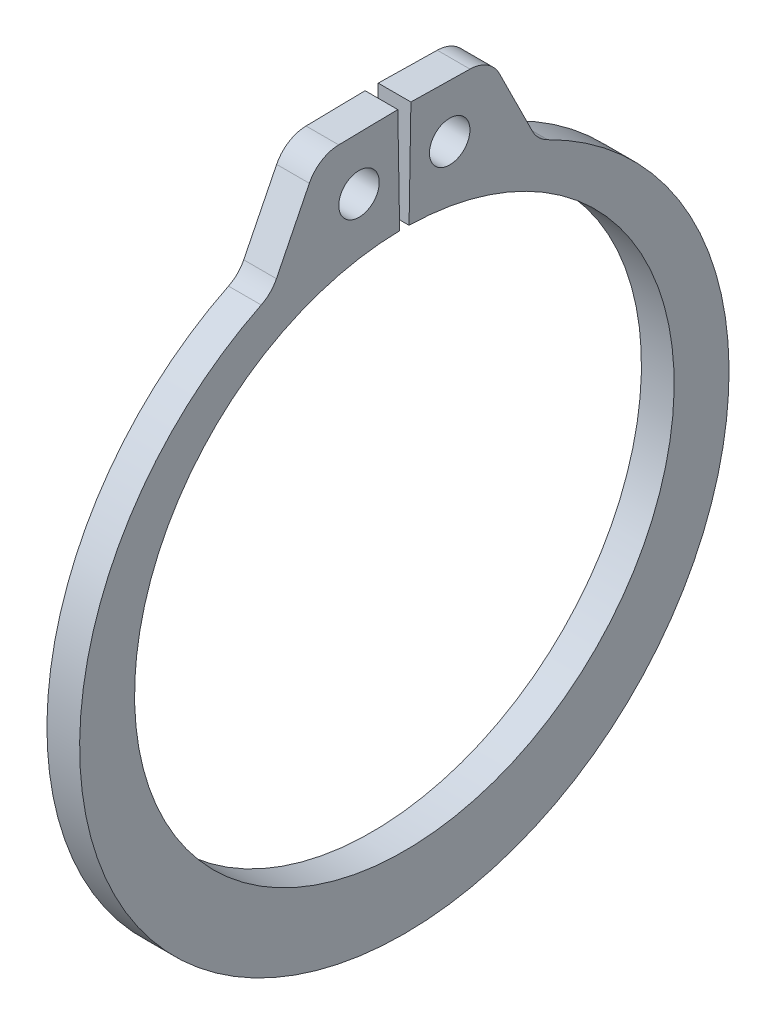
ISO-10303-21;
HEADER;
FILE_DESCRIPTION(('STEP AP214'),'2;1');
FILE_NAME('part.step','',(''),(''),'','','');
FILE_SCHEMA(('AUTOMOTIVE_DESIGN { 1 0 10303 214 1 1 1 1 }'));
ENDSEC;
DATA;
#1=APPLICATION_CONTEXT('core data for automotive mechanical design processes');
#2=APPLICATION_PROTOCOL_DEFINITION('international standard','automotive_design',2000,#1);
#3=PRODUCT_CONTEXT('',#1,'mechanical');
#4=PRODUCT('Part','Part','',(#3));
#5=PRODUCT_RELATED_PRODUCT_CATEGORY('part','',(#4));
#6=PRODUCT_DEFINITION_FORMATION('','',#4);
#7=PRODUCT_DEFINITION_CONTEXT('part definition',#1,'design');
#8=PRODUCT_DEFINITION('design','',#6,#7);
#9=PRODUCT_DEFINITION_SHAPE('','',#8);
#10=(LENGTH_UNIT() NAMED_UNIT(*) SI_UNIT(.MILLI.,.METRE.));
#11=(NAMED_UNIT(*) PLANE_ANGLE_UNIT() SI_UNIT($,.RADIAN.));
#12=(NAMED_UNIT(*) SI_UNIT($,.STERADIAN.) SOLID_ANGLE_UNIT());
#13=UNCERTAINTY_MEASURE_WITH_UNIT(LENGTH_MEASURE(1.E-05),#10,'distance_accuracy_value','');
#14=(GEOMETRIC_REPRESENTATION_CONTEXT(3) GLOBAL_UNCERTAINTY_ASSIGNED_CONTEXT((#13)) GLOBAL_UNIT_ASSIGNED_CONTEXT((#10,
#11,#12)) REPRESENTATION_CONTEXT('',''));
#15=CARTESIAN_POINT('',(0.,0.,0.));
#16=DIRECTION('',(0.,0.,1.));
#17=DIRECTION('',(1.,0.,0.));
#18=AXIS2_PLACEMENT_3D('',#15,#16,#17);
#19=CARTESIAN_POINT('',(0.5334,0.,0.));
#20=DIRECTION('',(1.,0.,0.));
#21=DIRECTION('',(0.,0.,-1.));
#22=AXIS2_PLACEMENT_3D('',#19,#20,#21);
#23=PLANE('',#22);
#24=CARTESIAN_POINT('',(0.5334,10.5040886416162,-1.47894687499924));
#25=DIRECTION('',(-1.,0.,0.));
#26=DIRECTION('',(0.,0.,1.));
#27=AXIS2_PLACEMENT_3D('',#24,#25,#26);
#28=CIRCLE('',#27,0.6604);
#29=CARTESIAN_POINT('',(0.5334,10.5040886416162,-0.818546874999241));
#30=VERTEX_POINT('',#29);
#31=EDGE_CURVE('E107',#30,#30,#28,.T.);
#32=ORIENTED_EDGE('',*,*,#31,.T.);
#33=EDGE_LOOP('',(#32));
#34=FACE_BOUND('',#33,.T.);
#35=CARTESIAN_POINT('',(0.5334,0.,0.));
#36=DIRECTION('',(-1.,0.,0.));
#37=DIRECTION('',(0.,0.,1.));
#38=AXIS2_PLACEMENT_3D('',#35,#36,#37);
#39=CIRCLE('',#38,8.8011);
#40=CARTESIAN_POINT('',(0.5334,8.79975954984091,-0.153600374295176));
#41=VERTEX_POINT('',#40);
#42=CARTESIAN_POINT('',(0.5334,8.79975954984091,0.153600374295176));
#43=VERTEX_POINT('',#42);
#44=EDGE_CURVE('E173',#41,#43,#39,.T.);
#45=ORIENTED_EDGE('',*,*,#44,.T.);
#46=DIRECTION('',(0.,-0.999847695156391,-0.0174524064372835));
#47=VECTOR('',#46,1.);
#48=CARTESIAN_POINT('',(0.5334,8.79975954984091,0.153600374295176));
#49=LINE('',#48,#47);
#50=CARTESIAN_POINT('',(0.5334,12.2536334279892,0.213887967092128));
#51=VERTEX_POINT('',#50);
#52=EDGE_CURVE('E123',#43,#51,#49,.F.);
#53=ORIENTED_EDGE('',*,*,#52,.T.);
#54=DIRECTION('',(0.,0.0174524064372834,-0.999847695156391));
#55=VECTOR('',#54,1.);
#56=CARTESIAN_POINT('',(0.5334,12.2536334279892,0.213887967092128));
#57=LINE('',#56,#55);
#58=CARTESIAN_POINT('',(0.5334,12.21999978275,2.14075821234738));
#59=VERTEX_POINT('',#58);
#60=EDGE_CURVE('E118',#51,#59,#57,.F.);
#61=ORIENTED_EDGE('',*,*,#60,.T.);
#62=CARTESIAN_POINT('',(0.5334,11.1279661301002,2.12169669403658));
#63=DIRECTION('',(-1.,0.,0.));
#64=DIRECTION('',(0.,0.,1.));
#65=AXIS2_PLACEMENT_3D('',#62,#63,#64);
#66=CIRCLE('',#65,1.0922);
#67=CARTESIAN_POINT('',(0.5334,11.6141614114107,3.09971253666458));
#68=VERTEX_POINT('',#67);
#69=EDGE_CURVE('E111',#68,#59,#66,.T.);
#70=ORIENTED_EDGE('',*,*,#69,.F.);
#71=DIRECTION('',(0.,0.895454900776411,-0.445152244378829));
#72=VECTOR('',#71,1.);
#73=CARTESIAN_POINT('',(0.5334,12.2084177333914,2.80429337570331));
#74=LINE('',#73,#72);
#75=CARTESIAN_POINT('',(0.5334,9.45539137797145,4.17288922557434));
#76=VERTEX_POINT('',#75);
#77=EDGE_CURVE('E106',#68,#76,#74,.F.);
#78=ORIENTED_EDGE('',*,*,#77,.T.);
#79=CARTESIAN_POINT('',(0.5334,9.941586659282,5.15090506820234));
#80=DIRECTION('',(-1.,0.,0.));
#81=DIRECTION('',(0.,0.,1.));
#82=AXIS2_PLACEMENT_3D('',#79,#80,#81);
#83=CIRCLE('',#82,1.0922);
#84=CARTESIAN_POINT('',(0.5334,8.96124610534802,4.66941442622431));
#85=VERTEX_POINT('',#84);
#86=EDGE_CURVE('E97',#76,#85,#83,.T.);
#87=ORIENTED_EDGE('',*,*,#86,.T.);
#88=CARTESIAN_POINT('',(0.5334,-0.545929997486656,0.));
#89=DIRECTION('',(-1.,0.,0.));
#90=DIRECTION('',(0.,0.,1.));
#91=AXIS2_PLACEMENT_3D('',#88,#89,#90);
#92=CIRCLE('',#91,10.5919700025133);
#93=CARTESIAN_POINT('',(0.5334,8.96124610534802,-4.66941442622431));
#94=VERTEX_POINT('',#93);
#95=EDGE_CURVE('E180',#94,#85,#92,.T.);
#96=ORIENTED_EDGE('',*,*,#95,.F.);
#97=CARTESIAN_POINT('',(0.5334,9.941586659282,-5.15090506820234));
#98=DIRECTION('',(-1.,0.,0.));
#99=DIRECTION('',(0.,0.,1.));
#100=AXIS2_PLACEMENT_3D('',#97,#98,#99);
#101=CIRCLE('',#100,1.0922);
#102=CARTESIAN_POINT('',(0.5334,9.45539137797145,-4.17288922557434));
#103=VERTEX_POINT('',#102);
#104=EDGE_CURVE('E177',#94,#103,#101,.T.);
#105=ORIENTED_EDGE('',*,*,#104,.T.);
#106=DIRECTION('',(0.,-0.895454900776411,-0.445152244378829));
#107=VECTOR('',#106,1.);
#108=CARTESIAN_POINT('',(0.5334,12.2084177333914,-2.80429337570331));
#109=LINE('',#108,#107);
#110=CARTESIAN_POINT('',(0.5334,11.6141614114107,-3.09971253666458));
#111=VERTEX_POINT('',#110);
#112=EDGE_CURVE('E142',#103,#111,#109,.F.);
#113=ORIENTED_EDGE('',*,*,#112,.T.);
#114=CARTESIAN_POINT('',(0.5334,11.1279661301002,-2.12169669403658));
#115=DIRECTION('',(-1.,0.,0.));
#116=DIRECTION('',(0.,0.,1.));
#117=AXIS2_PLACEMENT_3D('',#114,#115,#116);
#118=CIRCLE('',#117,1.0922);
#119=CARTESIAN_POINT('',(0.5334,12.21999978275,-2.14075821234738));
#120=VERTEX_POINT('',#119);
#121=EDGE_CURVE('E144',#120,#111,#118,.T.);
#122=ORIENTED_EDGE('',*,*,#121,.F.);
#123=DIRECTION('',(0.,-0.0174524064372834,-0.999847695156391));
#124=VECTOR('',#123,1.);
#125=CARTESIAN_POINT('',(0.5334,12.2536334279892,-0.213887967092128));
#126=LINE('',#125,#124);
#127=CARTESIAN_POINT('',(0.5334,12.2536334279892,-0.213887967092128));
#128=VERTEX_POINT('',#127);
#129=EDGE_CURVE('E136',#120,#128,#126,.F.);
#130=ORIENTED_EDGE('',*,*,#129,.T.);
#131=DIRECTION('',(0.,0.999847695156391,-0.0174524064372835));
#132=VECTOR('',#131,1.);
#133=CARTESIAN_POINT('',(0.5334,8.79975954984091,-0.153600374295176));
#134=LINE('',#133,#132);
#135=EDGE_CURVE('E129',#128,#41,#134,.F.);
#136=ORIENTED_EDGE('',*,*,#135,.T.);
#137=EDGE_LOOP('',(#45,#53,#61,#70,#78,#87,#96,#105,#113,#122,#130,#136));
#138=FACE_BOUND('',#137,.T.);
#139=CARTESIAN_POINT('',(0.5334,10.5040886416162,1.47894687499924));
#140=DIRECTION('',(-1.,0.,0.));
#141=DIRECTION('',(0.,0.,1.));
#142=AXIS2_PLACEMENT_3D('',#139,#140,#141);
#143=CIRCLE('',#142,0.6604);
#144=CARTESIAN_POINT('',(0.5334,10.5040886416162,2.13934687499924));
#145=VERTEX_POINT('',#144);
#146=EDGE_CURVE('E19',#145,#145,#143,.T.);
#147=ORIENTED_EDGE('',*,*,#146,.T.);
#148=EDGE_LOOP('',(#147));
#149=FACE_BOUND('',#148,.T.);
#150=ADVANCED_FACE('F16',(#34,#138,#149),#23,.T.);
#151=CARTESIAN_POINT('',(0.5334,10.5040886416162,1.47894687499924));
#152=DIRECTION('',(-1.,0.,0.));
#153=DIRECTION('',(0.,0.,1.));
#154=AXIS2_PLACEMENT_3D('',#151,#152,#153);
#155=CYLINDRICAL_SURFACE('',#154,0.6604);
#156=CARTESIAN_POINT('',(-0.5334,10.5040886416162,1.47894687499924));
#157=DIRECTION('',(-1.,0.,0.));
#158=DIRECTION('',(0.,0.,1.));
#159=AXIS2_PLACEMENT_3D('',#156,#157,#158);
#160=CIRCLE('',#159,0.6604);
#161=CARTESIAN_POINT('',(-0.5334,10.5040886416162,2.13934687499924));
#162=VERTEX_POINT('',#161);
#163=EDGE_CURVE('E167',#162,#162,#160,.T.);
#164=ORIENTED_EDGE('',*,*,#163,.T.);
#165=EDGE_LOOP('',(#164));
#166=FACE_BOUND('',#165,.T.);
#167=ORIENTED_EDGE('',*,*,#146,.F.);
#168=EDGE_LOOP('',(#167));
#169=FACE_BOUND('',#168,.T.);
#170=ADVANCED_FACE('F387',(#166,#169),#155,.F.);
#171=CARTESIAN_POINT('',(0.5334,9.941586659282,5.15090506820234));
#172=DIRECTION('',(-1.,0.,0.));
#173=DIRECTION('',(0.,0.,1.));
#174=AXIS2_PLACEMENT_3D('',#171,#172,#173);
#175=CYLINDRICAL_SURFACE('',#174,1.0922);
#176=DIRECTION('',(1.,0.,0.));
#177=VECTOR('',#176,1.);
#178=CARTESIAN_POINT('',(0.5334,9.45539137797145,4.17288922557434));
#179=LINE('',#178,#177);
#180=CARTESIAN_POINT('',(-0.5334,9.45539137797145,4.17288922557434));
#181=VERTEX_POINT('',#180);
#182=EDGE_CURVE('E101',#76,#181,#179,.F.);
#183=ORIENTED_EDGE('',*,*,#182,.T.);
#184=CARTESIAN_POINT('',(-0.5334,9.941586659282,5.15090506820234));
#185=DIRECTION('',(-1.,0.,0.));
#186=DIRECTION('',(0.,0.,1.));
#187=AXIS2_PLACEMENT_3D('',#184,#185,#186);
#188=CIRCLE('',#187,1.0922);
#189=CARTESIAN_POINT('',(-0.5334,8.96124610534802,4.66941442622431));
#190=VERTEX_POINT('',#189);
#191=EDGE_CURVE('E165',#181,#190,#188,.T.);
#192=ORIENTED_EDGE('',*,*,#191,.T.);
#193=DIRECTION('',(-1.,0.,0.));
#194=VECTOR('',#193,1.);
#195=CARTESIAN_POINT('',(0.5334,8.96124610534802,4.66941442622431));
#196=LINE('',#195,#194);
#197=EDGE_CURVE('E102',#85,#190,#196,.T.);
#198=ORIENTED_EDGE('',*,*,#197,.F.);
#199=ORIENTED_EDGE('',*,*,#86,.F.);
#200=EDGE_LOOP('',(#183,#192,#198,#199));
#201=FACE_BOUND('',#200,.T.);
#202=ADVANCED_FACE('F99',(#201),#175,.F.);
#203=CARTESIAN_POINT('',(0.5334,-0.545929997486656,0.));
#204=DIRECTION('',(-1.,0.,0.));
#205=DIRECTION('',(0.,0.,1.));
#206=AXIS2_PLACEMENT_3D('',#203,#204,#205);
#207=CYLINDRICAL_SURFACE('',#206,10.5919700025133);
#208=CARTESIAN_POINT('',(-0.5334,-0.545929997486656,0.));
#209=DIRECTION('',(-1.,0.,0.));
#210=DIRECTION('',(0.,0.,1.));
#211=AXIS2_PLACEMENT_3D('',#208,#209,#210);
#212=CIRCLE('',#211,10.5919700025133);
#213=CARTESIAN_POINT('',(-0.5334,8.96124610534802,-4.66941442622431));
#214=VERTEX_POINT('',#213);
#215=EDGE_CURVE('E163',#190,#214,#212,.F.);
#216=ORIENTED_EDGE('',*,*,#215,.T.);
#217=DIRECTION('',(-1.,0.,0.));
#218=VECTOR('',#217,1.);
#219=CARTESIAN_POINT('',(0.5334,8.96124610534802,-4.66941442622431));
#220=LINE('',#219,#218);
#221=EDGE_CURVE('E179',#214,#94,#220,.F.);
#222=ORIENTED_EDGE('',*,*,#221,.T.);
#223=ORIENTED_EDGE('',*,*,#95,.T.);
#224=ORIENTED_EDGE('',*,*,#197,.T.);
#225=EDGE_LOOP('',(#216,#222,#223,#224));
#226=FACE_BOUND('',#225,.T.);
#227=ADVANCED_FACE('F185',(#226),#207,.T.);
#228=CARTESIAN_POINT('',(0.5334,9.941586659282,-5.15090506820234));
#229=DIRECTION('',(-1.,0.,0.));
#230=DIRECTION('',(0.,0.,1.));
#231=AXIS2_PLACEMENT_3D('',#228,#229,#230);
#232=CYLINDRICAL_SURFACE('',#231,1.0922);
#233=ORIENTED_EDGE('',*,*,#221,.F.);
#234=CARTESIAN_POINT('',(-0.5334,9.941586659282,-5.15090506820234));
#235=DIRECTION('',(-1.,0.,0.));
#236=DIRECTION('',(0.,0.,1.));
#237=AXIS2_PLACEMENT_3D('',#234,#235,#236);
#238=CIRCLE('',#237,1.0922);
#239=CARTESIAN_POINT('',(-0.5334,9.45539137797145,-4.17288922557434));
#240=VERTEX_POINT('',#239);
#241=EDGE_CURVE('E160',#214,#240,#238,.T.);
#242=ORIENTED_EDGE('',*,*,#241,.T.);
#243=DIRECTION('',(1.,0.,0.));
#244=VECTOR('',#243,1.);
#245=CARTESIAN_POINT('',(0.5334,9.45539137797145,-4.17288922557434));
#246=LINE('',#245,#244);
#247=EDGE_CURVE('E145',#240,#103,#246,.T.);
#248=ORIENTED_EDGE('',*,*,#247,.T.);
#249=ORIENTED_EDGE('',*,*,#104,.F.);
#250=EDGE_LOOP('',(#233,#242,#248,#249));
#251=FACE_BOUND('',#250,.T.);
#252=ADVANCED_FACE('F197',(#251),#232,.F.);
#253=CARTESIAN_POINT('',(0.5334,12.2084177333914,-2.80429337570331));
#254=DIRECTION('',(0.,-0.445152244378829,0.895454900776411));
#255=DIRECTION('',(0.,-0.895454900776411,-0.445152244378829));
#256=AXIS2_PLACEMENT_3D('',#253,#254,#255);
#257=PLANE('',#256);
#258=ORIENTED_EDGE('',*,*,#247,.F.);
#259=DIRECTION('',(0.,0.895454900776411,0.445152244378828));
#260=VECTOR('',#259,1.);
#261=CARTESIAN_POINT('',(-0.5334,9.45539137797145,-4.17288922557434));
#262=LINE('',#261,#260);
#263=CARTESIAN_POINT('',(-0.5334,11.6141614114107,-3.09971253666458));
#264=VERTEX_POINT('',#263);
#265=EDGE_CURVE('E159',#240,#264,#262,.T.);
#266=ORIENTED_EDGE('',*,*,#265,.T.);
#267=DIRECTION('',(-1.,0.,0.));
#268=VECTOR('',#267,1.);
#269=CARTESIAN_POINT('',(0.5334,11.6141614114107,-3.09971253666458));
#270=LINE('',#269,#268);
#271=EDGE_CURVE('E176',#111,#264,#270,.T.);
#272=ORIENTED_EDGE('',*,*,#271,.F.);
#273=ORIENTED_EDGE('',*,*,#112,.F.);
#274=EDGE_LOOP('',(#258,#266,#272,#273));
#275=FACE_BOUND('',#274,.T.);
#276=ADVANCED_FACE('F202',(#275),#257,.F.);
#277=CARTESIAN_POINT('',(0.5334,11.1279661301002,-2.12169669403658));
#278=DIRECTION('',(-1.,0.,0.));
#279=DIRECTION('',(0.,0.,1.));
#280=AXIS2_PLACEMENT_3D('',#277,#278,#279);
#281=CYLINDRICAL_SURFACE('',#280,1.0922);
#282=CARTESIAN_POINT('',(-0.5334,11.1279661301002,-2.12169669403658));
#283=DIRECTION('',(-1.,0.,0.));
#284=DIRECTION('',(0.,0.,1.));
#285=AXIS2_PLACEMENT_3D('',#282,#283,#284);
#286=CIRCLE('',#285,1.0922);
#287=CARTESIAN_POINT('',(-0.5334,12.21999978275,-2.14075821234738));
#288=VERTEX_POINT('',#287);
#289=EDGE_CURVE('E155',#264,#288,#286,.F.);
#290=ORIENTED_EDGE('',*,*,#289,.T.);
#291=DIRECTION('',(1.,0.,0.));
#292=VECTOR('',#291,1.);
#293=CARTESIAN_POINT('',(0.5334,12.21999978275,-2.14075821234738));
#294=LINE('',#293,#292);
#295=EDGE_CURVE('E139',#288,#120,#294,.T.);
#296=ORIENTED_EDGE('',*,*,#295,.T.);
#297=ORIENTED_EDGE('',*,*,#121,.T.);
#298=ORIENTED_EDGE('',*,*,#271,.T.);
#299=EDGE_LOOP('',(#290,#296,#297,#298));
#300=FACE_BOUND('',#299,.T.);
#301=ADVANCED_FACE('F265',(#300),#281,.T.);
#302=CARTESIAN_POINT('',(0.5334,12.2536334279892,-0.213887967092128));
#303=DIRECTION('',(0.,-0.999847695156391,0.0174524064372834));
#304=DIRECTION('',(0.,-0.0174524064372834,-0.999847695156391));
#305=AXIS2_PLACEMENT_3D('',#302,#303,#304);
#306=PLANE('',#305);
#307=ORIENTED_EDGE('',*,*,#295,.F.);
#308=DIRECTION('',(0.,0.0174524064372837,0.999847695156391));
#309=VECTOR('',#308,1.);
#310=CARTESIAN_POINT('',(-0.5334,12.21999978275,-2.14075821234738));
#311=LINE('',#310,#309);
#312=CARTESIAN_POINT('',(-0.5334,12.2536334279892,-0.213887967092128));
#313=VERTEX_POINT('',#312);
#314=EDGE_CURVE('E158',#288,#313,#311,.T.);
#315=ORIENTED_EDGE('',*,*,#314,.T.);
#316=DIRECTION('',(1.,0.,0.));
#317=VECTOR('',#316,1.);
#318=CARTESIAN_POINT('',(0.5334,12.2536334279892,-0.213887967092128));
#319=LINE('',#318,#317);
#320=EDGE_CURVE('E133',#313,#128,#319,.T.);
#321=ORIENTED_EDGE('',*,*,#320,.T.);
#322=ORIENTED_EDGE('',*,*,#129,.F.);
#323=EDGE_LOOP('',(#307,#315,#321,#322));
#324=FACE_BOUND('',#323,.T.);
#325=ADVANCED_FACE('F263',(#324),#306,.F.);
#326=CARTESIAN_POINT('',(0.5334,8.79975954984091,-0.153600374295176));
#327=DIRECTION('',(0.,-0.0174524064372835,-0.999847695156391));
#328=DIRECTION('',(0.,0.999847695156391,-0.0174524064372835));
#329=AXIS2_PLACEMENT_3D('',#326,#327,#328);
#330=PLANE('',#329);
#331=DIRECTION('',(-1.,0.,0.));
#332=VECTOR('',#331,1.);
#333=CARTESIAN_POINT('',(0.5334,8.79975954984091,-0.153600374295176));
#334=LINE('',#333,#332);
#335=CARTESIAN_POINT('',(-0.5334,8.79975954984091,-0.153600374295176));
#336=VERTEX_POINT('',#335);
#337=EDGE_CURVE('E132',#336,#41,#334,.F.);
#338=ORIENTED_EDGE('',*,*,#337,.T.);
#339=ORIENTED_EDGE('',*,*,#135,.F.);
#340=ORIENTED_EDGE('',*,*,#320,.F.);
#341=DIRECTION('',(0.,-0.999847695156391,0.0174524064372835));
#342=VECTOR('',#341,1.);
#343=CARTESIAN_POINT('',(-0.5334,12.2536334279892,-0.213887967092128));
#344=LINE('',#343,#342);
#345=EDGE_CURVE('E154',#313,#336,#344,.T.);
#346=ORIENTED_EDGE('',*,*,#345,.T.);
#347=EDGE_LOOP('',(#338,#339,#340,#346));
#348=FACE_BOUND('',#347,.T.);
#349=ADVANCED_FACE('F258',(#348),#330,.F.);
#350=CARTESIAN_POINT('',(0.5334,0.,0.));
#351=DIRECTION('',(-1.,0.,0.));
#352=DIRECTION('',(0.,0.,1.));
#353=AXIS2_PLACEMENT_3D('',#350,#351,#352);
#354=CYLINDRICAL_SURFACE('',#353,8.8011);
#355=ORIENTED_EDGE('',*,*,#44,.F.);
#356=ORIENTED_EDGE('',*,*,#337,.F.);
#357=CARTESIAN_POINT('',(-0.5334,0.,0.));
#358=DIRECTION('',(-1.,0.,0.));
#359=DIRECTION('',(0.,0.,1.));
#360=AXIS2_PLACEMENT_3D('',#357,#358,#359);
#361=CIRCLE('',#360,8.8011);
#362=CARTESIAN_POINT('',(-0.5334,8.79975954984091,0.153600374295176));
#363=VERTEX_POINT('',#362);
#364=EDGE_CURVE('E151',#336,#363,#361,.T.);
#365=ORIENTED_EDGE('',*,*,#364,.T.);
#366=DIRECTION('',(1.,0.,0.));
#367=VECTOR('',#366,1.);
#368=CARTESIAN_POINT('',(0.5334,8.79975954984091,0.153600374295176));
#369=LINE('',#368,#367);
#370=EDGE_CURVE('E126',#363,#43,#369,.T.);
#371=ORIENTED_EDGE('',*,*,#370,.T.);
#372=EDGE_LOOP('',(#355,#356,#365,#371));
#373=FACE_BOUND('',#372,.T.);
#374=ADVANCED_FACE('F253',(#373),#354,.F.);
#375=CARTESIAN_POINT('',(0.5334,8.79975954984091,0.153600374295176));
#376=DIRECTION('',(0.,-0.0174524064372835,0.999847695156391));
#377=DIRECTION('',(0.,-0.999847695156391,-0.0174524064372835));
#378=AXIS2_PLACEMENT_3D('',#375,#376,#377);
#379=PLANE('',#378);
#380=DIRECTION('',(1.,0.,0.));
#381=VECTOR('',#380,1.);
#382=CARTESIAN_POINT('',(0.5334,12.2536334279892,0.213887967092128));
#383=LINE('',#382,#381);
#384=CARTESIAN_POINT('',(-0.5334,12.2536334279892,0.213887967092128));
#385=VERTEX_POINT('',#384);
#386=EDGE_CURVE('E120',#385,#51,#383,.T.);
#387=ORIENTED_EDGE('',*,*,#386,.T.);
#388=ORIENTED_EDGE('',*,*,#52,.F.);
#389=ORIENTED_EDGE('',*,*,#370,.F.);
#390=DIRECTION('',(0.,0.999847695156391,0.0174524064372835));
#391=VECTOR('',#390,1.);
#392=CARTESIAN_POINT('',(-0.5334,8.79975954984091,0.153600374295176));
#393=LINE('',#392,#391);
#394=EDGE_CURVE('E153',#363,#385,#393,.T.);
#395=ORIENTED_EDGE('',*,*,#394,.T.);
#396=EDGE_LOOP('',(#387,#388,#389,#395));
#397=FACE_BOUND('',#396,.T.);
#398=ADVANCED_FACE('F250',(#397),#379,.F.);
#399=CARTESIAN_POINT('',(0.5334,12.2536334279892,0.213887967092128));
#400=DIRECTION('',(0.,-0.999847695156391,-0.0174524064372834));
#401=DIRECTION('',(0.,0.0174524064372834,-0.999847695156391));
#402=AXIS2_PLACEMENT_3D('',#399,#400,#401);
#403=PLANE('',#402);
#404=DIRECTION('',(-1.,0.,0.));
#405=VECTOR('',#404,1.);
#406=CARTESIAN_POINT('',(0.5334,12.21999978275,2.14075821234738));
#407=LINE('',#406,#405);
#408=CARTESIAN_POINT('',(-0.5334,12.21999978275,2.14075821234738));
#409=VERTEX_POINT('',#408);
#410=EDGE_CURVE('E113',#59,#409,#407,.T.);
#411=ORIENTED_EDGE('',*,*,#410,.F.);
#412=ORIENTED_EDGE('',*,*,#60,.F.);
#413=ORIENTED_EDGE('',*,*,#386,.F.);
#414=DIRECTION('',(0.,-0.0174524064372837,0.999847695156391));
#415=VECTOR('',#414,1.);
#416=CARTESIAN_POINT('',(-0.5334,12.2536334279892,0.213887967092128));
#417=LINE('',#416,#415);
#418=EDGE_CURVE('E150',#385,#409,#417,.T.);
#419=ORIENTED_EDGE('',*,*,#418,.T.);
#420=EDGE_LOOP('',(#411,#412,#413,#419));
#421=FACE_BOUND('',#420,.T.);
#422=ADVANCED_FACE('F243',(#421),#403,.F.);
#423=CARTESIAN_POINT('',(0.5334,11.1279661301002,2.12169669403658));
#424=DIRECTION('',(-1.,0.,0.));
#425=DIRECTION('',(0.,0.,1.));
#426=AXIS2_PLACEMENT_3D('',#423,#424,#425);
#427=CYLINDRICAL_SURFACE('',#426,1.0922);
#428=CARTESIAN_POINT('',(-0.5334,11.1279661301002,2.12169669403658));
#429=DIRECTION('',(-1.,0.,0.));
#430=DIRECTION('',(0.,0.,1.));
#431=AXIS2_PLACEMENT_3D('',#428,#429,#430);
#432=CIRCLE('',#431,1.0922);
#433=CARTESIAN_POINT('',(-0.5334,11.6141614114107,3.09971253666458));
#434=VERTEX_POINT('',#433);
#435=EDGE_CURVE('E147',#409,#434,#432,.F.);
#436=ORIENTED_EDGE('',*,*,#435,.T.);
#437=DIRECTION('',(1.,0.,0.));
#438=VECTOR('',#437,1.);
#439=CARTESIAN_POINT('',(0.5334,11.6141614114107,3.09971253666458));
#440=LINE('',#439,#438);
#441=EDGE_CURVE('E34',#434,#68,#440,.T.);
#442=ORIENTED_EDGE('',*,*,#441,.T.);
#443=ORIENTED_EDGE('',*,*,#69,.T.);
#444=ORIENTED_EDGE('',*,*,#410,.T.);
#445=EDGE_LOOP('',(#436,#442,#443,#444));
#446=FACE_BOUND('',#445,.T.);
#447=ADVANCED_FACE('F288',(#446),#427,.T.);
#448=CARTESIAN_POINT('',(0.5334,12.2084177333914,2.80429337570331));
#449=DIRECTION('',(0.,-0.445152244378829,-0.895454900776411));
#450=DIRECTION('',(0.,0.895454900776411,-0.445152244378829));
#451=AXIS2_PLACEMENT_3D('',#448,#449,#450);
#452=PLANE('',#451);
#453=ORIENTED_EDGE('',*,*,#182,.F.);
#454=ORIENTED_EDGE('',*,*,#77,.F.);
#455=ORIENTED_EDGE('',*,*,#441,.F.);
#456=DIRECTION('',(0.,-0.895454900776411,0.445152244378828));
#457=VECTOR('',#456,1.);
#458=CARTESIAN_POINT('',(-0.5334,11.6141614114107,3.09971253666458));
#459=LINE('',#458,#457);
#460=EDGE_CURVE('E25',#434,#181,#459,.T.);
#461=ORIENTED_EDGE('',*,*,#460,.T.);
#462=EDGE_LOOP('',(#453,#454,#455,#461));
#463=FACE_BOUND('',#462,.T.);
#464=ADVANCED_FACE('F105',(#463),#452,.F.);
#465=CARTESIAN_POINT('',(0.5334,10.5040886416162,-1.47894687499924));
#466=DIRECTION('',(-1.,0.,0.));
#467=DIRECTION('',(0.,0.,1.));
#468=AXIS2_PLACEMENT_3D('',#465,#466,#467);
#469=CYLINDRICAL_SURFACE('',#468,0.6604);
#470=CARTESIAN_POINT('',(-0.5334,10.5040886416162,-1.47894687499924));
#471=DIRECTION('',(-1.,0.,0.));
#472=DIRECTION('',(0.,0.,1.));
#473=AXIS2_PLACEMENT_3D('',#470,#471,#472);
#474=CIRCLE('',#473,0.6604);
#475=CARTESIAN_POINT('',(-0.5334,10.5040886416162,-0.818546874999241));
#476=VERTEX_POINT('',#475);
#477=EDGE_CURVE('E11',#476,#476,#474,.T.);
#478=ORIENTED_EDGE('',*,*,#477,.T.);
#479=EDGE_LOOP('',(#478));
#480=FACE_BOUND('',#479,.T.);
#481=ORIENTED_EDGE('',*,*,#31,.F.);
#482=EDGE_LOOP('',(#481));
#483=FACE_BOUND('',#482,.T.);
#484=ADVANCED_FACE('F276',(#480,#483),#469,.F.);
#485=CARTESIAN_POINT('',(-0.5334,0.,0.));
#486=DIRECTION('',(1.,0.,0.));
#487=DIRECTION('',(0.,0.,-1.));
#488=AXIS2_PLACEMENT_3D('',#485,#486,#487);
#489=PLANE('',#488);
#490=ORIENTED_EDGE('',*,*,#477,.F.);
#491=EDGE_LOOP('',(#490));
#492=FACE_BOUND('',#491,.T.);
#493=ORIENTED_EDGE('',*,*,#435,.F.);
#494=ORIENTED_EDGE('',*,*,#418,.F.);
#495=ORIENTED_EDGE('',*,*,#394,.F.);
#496=ORIENTED_EDGE('',*,*,#364,.F.);
#497=ORIENTED_EDGE('',*,*,#345,.F.);
#498=ORIENTED_EDGE('',*,*,#314,.F.);
#499=ORIENTED_EDGE('',*,*,#289,.F.);
#500=ORIENTED_EDGE('',*,*,#265,.F.);
#501=ORIENTED_EDGE('',*,*,#241,.F.);
#502=ORIENTED_EDGE('',*,*,#215,.F.);
#503=ORIENTED_EDGE('',*,*,#191,.F.);
#504=ORIENTED_EDGE('',*,*,#460,.F.);
#505=EDGE_LOOP('',(#493,#494,#495,#496,#497,#498,#499,#500,#501,#502,#503,#504));
#506=FACE_BOUND('',#505,.T.);
#507=ORIENTED_EDGE('',*,*,#163,.F.);
#508=EDGE_LOOP('',(#507));
#509=FACE_BOUND('',#508,.T.);
#510=ADVANCED_FACE('F190',(#492,#506,#509),#489,.F.);
#511=CLOSED_SHELL('',(#150,#170,#202,#227,#252,#276,#301,#325,#349,#374,#398,#422,#447,#464,
#484,#510));
#512=MANIFOLD_SOLID_BREP('B1',#511);
#513=ADVANCED_BREP_SHAPE_REPRESENTATION('',(#18,#512),#14);
#514=SHAPE_DEFINITION_REPRESENTATION(#9,#513);
ENDSEC;
END-ISO-10303-21;
